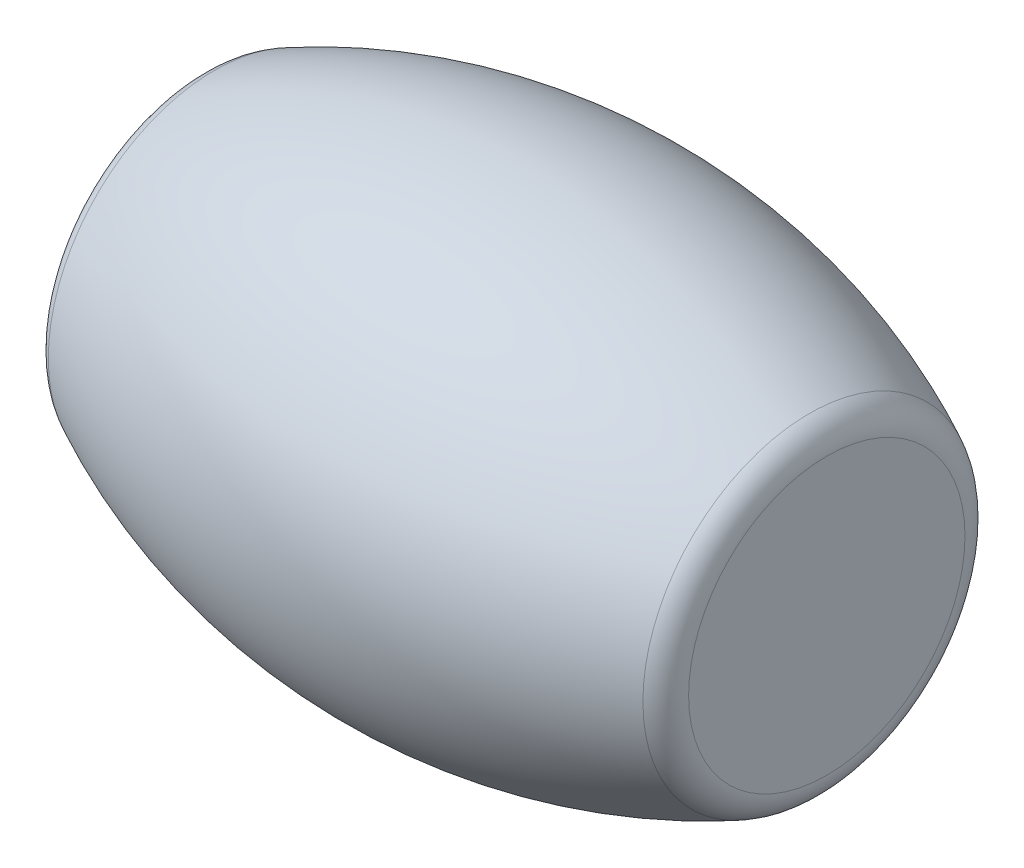
ISO-10303-21;
HEADER;
FILE_DESCRIPTION(('STEP AP214'),'2;1');
FILE_NAME('part.step','',(''),(''),'','','');
FILE_SCHEMA(('AUTOMOTIVE_DESIGN { 1 0 10303 214 1 1 1 1 }'));
ENDSEC;
DATA;
#1=APPLICATION_CONTEXT('core data for automotive mechanical design processes');
#2=APPLICATION_PROTOCOL_DEFINITION('international standard','automotive_design',2000,#1);
#3=PRODUCT_CONTEXT('',#1,'mechanical');
#4=PRODUCT('Part','Part','',(#3));
#5=PRODUCT_RELATED_PRODUCT_CATEGORY('part','',(#4));
#6=PRODUCT_DEFINITION_FORMATION('','',#4);
#7=PRODUCT_DEFINITION_CONTEXT('part definition',#1,'design');
#8=PRODUCT_DEFINITION('design','',#6,#7);
#9=PRODUCT_DEFINITION_SHAPE('','',#8);
#10=(LENGTH_UNIT() NAMED_UNIT(*) SI_UNIT(.MILLI.,.METRE.));
#11=(NAMED_UNIT(*) PLANE_ANGLE_UNIT() SI_UNIT($,.RADIAN.));
#12=(NAMED_UNIT(*) SI_UNIT($,.STERADIAN.) SOLID_ANGLE_UNIT());
#13=UNCERTAINTY_MEASURE_WITH_UNIT(LENGTH_MEASURE(1.E-05),#10,'distance_accuracy_value','');
#14=(GEOMETRIC_REPRESENTATION_CONTEXT(3) GLOBAL_UNCERTAINTY_ASSIGNED_CONTEXT((#13)) GLOBAL_UNIT_ASSIGNED_CONTEXT((#10,
#11,#12)) REPRESENTATION_CONTEXT('',''));
#15=CARTESIAN_POINT('',(0.,0.,0.));
#16=DIRECTION('',(0.,0.,1.));
#17=DIRECTION('',(1.,0.,0.));
#18=AXIS2_PLACEMENT_3D('',#15,#16,#17);
#19=CARTESIAN_POINT('',(0.,0.,0.));
#20=DIRECTION('',(-1.,0.,0.));
#21=DIRECTION('',(0.,0.,1.));
#22=AXIS2_PLACEMENT_3D('',#19,#20,#21);
#23=DEGENERATE_TOROIDAL_SURFACE('',#22,34.9250000000001,53.9750000000001,.F.);
#24=CARTESIAN_POINT('',(-23.9888888888889,0.,0.));
#25=DIRECTION('',(1.,0.,0.));
#26=DIRECTION('',(0.,0.,-1.));
#27=AXIS2_PLACEMENT_3D('',#24,#25,#26);
#28=CIRCLE('',#27,13.4261513293794);
#29=CARTESIAN_POINT('',(-23.9888888888889,0.,-13.4261513293794));
#30=VERTEX_POINT('',#29);
#31=EDGE_CURVE('E10',#30,#30,#28,.T.);
#32=ORIENTED_EDGE('',*,*,#31,.T.);
#33=EDGE_LOOP('',(#32));
#34=FACE_BOUND('',#33,.T.);
#35=CARTESIAN_POINT('',(23.9888888888889,0.,0.));
#36=DIRECTION('',(-1.,0.,0.));
#37=DIRECTION('',(0.,0.,1.));
#38=AXIS2_PLACEMENT_3D('',#35,#36,#37);
#39=CIRCLE('',#38,13.4261513293794);
#40=CARTESIAN_POINT('',(23.9888888888889,0.,13.4261513293794));
#41=VERTEX_POINT('',#40);
#42=EDGE_CURVE('E47',#41,#41,#39,.T.);
#43=ORIENTED_EDGE('',*,*,#42,.T.);
#44=EDGE_LOOP('',(#43));
#45=FACE_BOUND('',#44,.T.);
#46=ADVANCED_FACE('F32',(#34,#45),#23,.F.);
#47=CARTESIAN_POINT('',(25.4,0.,0.));
#48=DIRECTION('',(-1.,0.,0.));
#49=DIRECTION('',(0.,0.,1.));
#50=AXIS2_PLACEMENT_3D('',#47,#48,#49);
#51=PLANE('',#50);
#52=CARTESIAN_POINT('',(25.4,0.,0.));
#53=DIRECTION('',(-1.,0.,0.));
#54=DIRECTION('',(0.,0.,1.));
#55=AXIS2_PLACEMENT_3D('',#52,#53,#54);
#56=CIRCLE('',#55,11.1508030315262);
#57=CARTESIAN_POINT('',(25.4,0.,11.1508030315262));
#58=VERTEX_POINT('',#57);
#59=EDGE_CURVE('E43',#58,#58,#56,.F.);
#60=ORIENTED_EDGE('',*,*,#59,.T.);
#61=EDGE_LOOP('',(#60));
#62=FACE_BOUND('',#61,.T.);
#63=ADVANCED_FACE('F57',(#62),#51,.F.);
#64=CARTESIAN_POINT('',(22.86,0.,0.));
#65=DIRECTION('',(-1.,0.,0.));
#66=DIRECTION('',(0.,0.,1.));
#67=AXIS2_PLACEMENT_3D('',#64,#65,#66);
#68=TOROIDAL_SURFACE('',#67,11.1508030315262,2.54);
#69=ORIENTED_EDGE('',*,*,#59,.F.);
#70=EDGE_LOOP('',(#69));
#71=FACE_BOUND('',#70,.T.);
#72=ORIENTED_EDGE('',*,*,#42,.F.);
#73=EDGE_LOOP('',(#72));
#74=FACE_BOUND('',#73,.T.);
#75=ADVANCED_FACE('F54',(#71,#74),#68,.T.);
#76=CARTESIAN_POINT('',(-25.4,0.,0.));
#77=DIRECTION('',(1.,0.,0.));
#78=DIRECTION('',(0.,0.,1.));
#79=AXIS2_PLACEMENT_3D('',#76,#77,#78);
#80=PLANE('',#79);
#81=CARTESIAN_POINT('',(-25.4,0.,0.));
#82=DIRECTION('',(1.,0.,0.));
#83=DIRECTION('',(0.,0.,-1.));
#84=AXIS2_PLACEMENT_3D('',#81,#82,#83);
#85=CIRCLE('',#84,11.1508030315262);
#86=CARTESIAN_POINT('',(-25.4,0.,-11.1508030315262));
#87=VERTEX_POINT('',#86);
#88=EDGE_CURVE('E39',#87,#87,#85,.F.);
#89=ORIENTED_EDGE('',*,*,#88,.T.);
#90=EDGE_LOOP('',(#89));
#91=FACE_BOUND('',#90,.T.);
#92=ADVANCED_FACE('F56',(#91),#80,.F.);
#93=CARTESIAN_POINT('',(-22.86,0.,0.));
#94=DIRECTION('',(1.,0.,0.));
#95=DIRECTION('',(0.,0.,-1.));
#96=AXIS2_PLACEMENT_3D('',#93,#94,#95);
#97=TOROIDAL_SURFACE('',#96,11.1508030315262,2.54);
#98=ORIENTED_EDGE('',*,*,#31,.F.);
#99=EDGE_LOOP('',(#98));
#100=FACE_BOUND('',#99,.T.);
#101=ORIENTED_EDGE('',*,*,#88,.F.);
#102=EDGE_LOOP('',(#101));
#103=FACE_BOUND('',#102,.T.);
#104=ADVANCED_FACE('F34',(#100,#103),#97,.T.);
#105=CLOSED_SHELL('',(#46,#63,#75,#92,#104));
#106=MANIFOLD_SOLID_BREP('B2',#105);
#107=ADVANCED_BREP_SHAPE_REPRESENTATION('',(#18,#106),#14);
#108=SHAPE_DEFINITION_REPRESENTATION(#9,#107);
ENDSEC;
END-ISO-10303-21;
